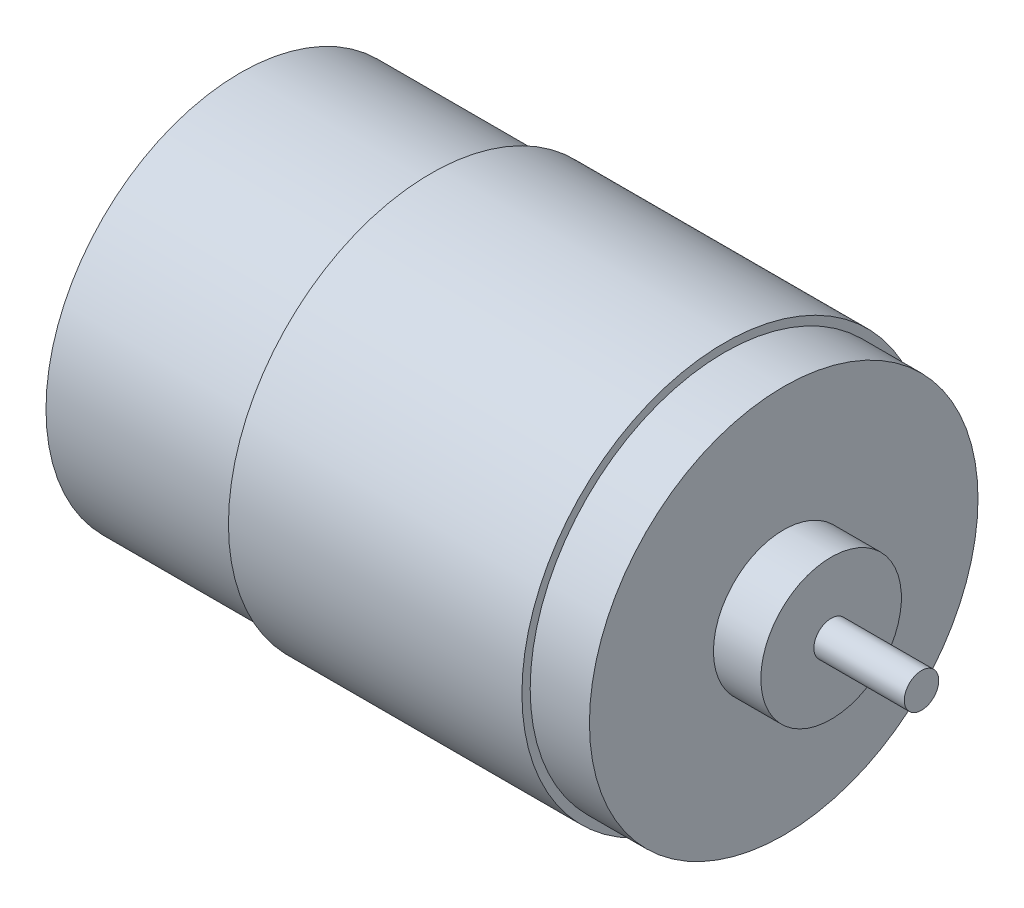
ISO-10303-21;
HEADER;
FILE_DESCRIPTION(('STEP AP214'),'2;1');
FILE_NAME('part.step','',(''),(''),'','','');
FILE_SCHEMA(('AUTOMOTIVE_DESIGN { 1 0 10303 214 1 1 1 1 }'));
ENDSEC;
DATA;
#1=APPLICATION_CONTEXT('core data for automotive mechanical design processes');
#2=APPLICATION_PROTOCOL_DEFINITION('international standard','automotive_design',2000,#1);
#3=PRODUCT_CONTEXT('',#1,'mechanical');
#4=PRODUCT('Part','Part','',(#3));
#5=PRODUCT_RELATED_PRODUCT_CATEGORY('part','',(#4));
#6=PRODUCT_DEFINITION_FORMATION('','',#4);
#7=PRODUCT_DEFINITION_CONTEXT('part definition',#1,'design');
#8=PRODUCT_DEFINITION('design','',#6,#7);
#9=PRODUCT_DEFINITION_SHAPE('','',#8);
#10=(LENGTH_UNIT() NAMED_UNIT(*) SI_UNIT(.MILLI.,.METRE.));
#11=(NAMED_UNIT(*) PLANE_ANGLE_UNIT() SI_UNIT($,.RADIAN.));
#12=(NAMED_UNIT(*) SI_UNIT($,.STERADIAN.) SOLID_ANGLE_UNIT());
#13=UNCERTAINTY_MEASURE_WITH_UNIT(LENGTH_MEASURE(1.E-05),#10,'distance_accuracy_value','');
#14=(GEOMETRIC_REPRESENTATION_CONTEXT(3) GLOBAL_UNCERTAINTY_ASSIGNED_CONTEXT((#13)) GLOBAL_UNIT_ASSIGNED_CONTEXT((#10,
#11,#12)) REPRESENTATION_CONTEXT('',''));
#15=CARTESIAN_POINT('',(0.,0.,0.));
#16=DIRECTION('',(0.,0.,1.));
#17=DIRECTION('',(1.,0.,0.));
#18=AXIS2_PLACEMENT_3D('',#15,#16,#17);
#19=CARTESIAN_POINT('',(-29.8040836820084,0.,0.));
#20=DIRECTION('',(1.,0.,0.));
#21=DIRECTION('',(0.,0.,-1.));
#22=AXIS2_PLACEMENT_3D('',#19,#20,#21);
#23=PLANE('',#22);
#24=CARTESIAN_POINT('',(-29.8040836820084,0.,0.));
#25=DIRECTION('',(-1.,0.,0.));
#26=DIRECTION('',(0.,0.,1.));
#27=AXIS2_PLACEMENT_3D('',#24,#25,#26);
#28=CIRCLE('',#27,1.53462761506276);
#29=CARTESIAN_POINT('',(-29.8040836820084,0.,1.53462761506276));
#30=VERTEX_POINT('',#29);
#31=EDGE_CURVE('E10',#30,#30,#28,.T.);
#32=ORIENTED_EDGE('',*,*,#31,.T.);
#33=EDGE_LOOP('',(#32));
#34=FACE_BOUND('',#33,.T.);
#35=ADVANCED_FACE('F33',(#34),#23,.F.);
#36=CARTESIAN_POINT('',(-37.6387615062761,0.,0.));
#37=DIRECTION('',(-1.,0.,0.));
#38=DIRECTION('',(0.,0.,1.));
#39=AXIS2_PLACEMENT_3D('',#36,#37,#38);
#40=CYLINDRICAL_SURFACE('',#39,1.53462761506276);
#41=ORIENTED_EDGE('',*,*,#31,.F.);
#42=EDGE_LOOP('',(#41));
#43=FACE_BOUND('',#42,.T.);
#44=CARTESIAN_POINT('',(-28.9156150627615,0.,0.));
#45=DIRECTION('',(-1.,0.,0.));
#46=DIRECTION('',(0.,0.,1.));
#47=AXIS2_PLACEMENT_3D('',#44,#45,#46);
#48=CIRCLE('',#47,1.53462761506276);
#49=CARTESIAN_POINT('',(-28.9156150627615,0.,1.53462761506276));
#50=VERTEX_POINT('',#49);
#51=EDGE_CURVE('E39',#50,#50,#48,.T.);
#52=ORIENTED_EDGE('',*,*,#51,.T.);
#53=EDGE_LOOP('',(#52));
#54=FACE_BOUND('',#53,.T.);
#55=ADVANCED_FACE('F104',(#43,#54),#40,.T.);
#56=CARTESIAN_POINT('',(-28.9156150627615,1.53462761506276,0.));
#57=DIRECTION('',(1.,0.,0.));
#58=DIRECTION('',(0.,0.,-1.));
#59=AXIS2_PLACEMENT_3D('',#56,#57,#58);
#60=PLANE('',#59);
#61=ORIENTED_EDGE('',*,*,#51,.F.);
#62=EDGE_LOOP('',(#61));
#63=FACE_BOUND('',#62,.T.);
#64=CARTESIAN_POINT('',(-28.9156150627615,0.,0.));
#65=DIRECTION('',(-1.,0.,0.));
#66=DIRECTION('',(0.,0.,1.));
#67=AXIS2_PLACEMENT_3D('',#64,#65,#66);
#68=CIRCLE('',#67,2.66540585774058);
#69=CARTESIAN_POINT('',(-28.9156150627615,0.,2.66540585774058));
#70=VERTEX_POINT('',#69);
#71=EDGE_CURVE('E43',#70,#70,#68,.T.);
#72=ORIENTED_EDGE('',*,*,#71,.T.);
#73=EDGE_LOOP('',(#72));
#74=FACE_BOUND('',#73,.T.);
#75=ADVANCED_FACE('F108',(#63,#74),#60,.F.);
#76=CARTESIAN_POINT('',(-37.6387615062761,0.,0.));
#77=DIRECTION('',(-1.,0.,0.));
#78=DIRECTION('',(0.,0.,1.));
#79=AXIS2_PLACEMENT_3D('',#76,#77,#78);
#80=CYLINDRICAL_SURFACE('',#79,2.66540585774058);
#81=ORIENTED_EDGE('',*,*,#71,.F.);
#82=EDGE_LOOP('',(#81));
#83=FACE_BOUND('',#82,.T.);
#84=CARTESIAN_POINT('',(-27.6232970711297,0.,0.));
#85=DIRECTION('',(-1.,0.,0.));
#86=DIRECTION('',(0.,0.,1.));
#87=AXIS2_PLACEMENT_3D('',#84,#85,#86);
#88=CIRCLE('',#87,2.66540585774058);
#89=CARTESIAN_POINT('',(-27.6232970711297,0.,2.66540585774058));
#90=VERTEX_POINT('',#89);
#91=EDGE_CURVE('E47',#90,#90,#88,.T.);
#92=ORIENTED_EDGE('',*,*,#91,.T.);
#93=EDGE_LOOP('',(#92));
#94=FACE_BOUND('',#93,.T.);
#95=ADVANCED_FACE('F113',(#83,#94),#80,.T.);
#96=CARTESIAN_POINT('',(-27.6232970711297,2.66540585774058,0.));
#97=DIRECTION('',(1.,0.,0.));
#98=DIRECTION('',(0.,0.,-1.));
#99=AXIS2_PLACEMENT_3D('',#96,#97,#98);
#100=PLANE('',#99);
#101=ORIENTED_EDGE('',*,*,#91,.F.);
#102=EDGE_LOOP('',(#101));
#103=FACE_BOUND('',#102,.T.);
#104=CARTESIAN_POINT('',(-27.6232970711297,0.,0.));
#105=DIRECTION('',(-1.,0.,0.));
#106=DIRECTION('',(0.,0.,1.));
#107=AXIS2_PLACEMENT_3D('',#104,#105,#106);
#108=CIRCLE('',#107,4.76542259414226);
#109=CARTESIAN_POINT('',(-27.6232970711297,0.,4.76542259414226));
#110=VERTEX_POINT('',#109);
#111=EDGE_CURVE('E52',#110,#110,#108,.T.);
#112=ORIENTED_EDGE('',*,*,#111,.T.);
#113=EDGE_LOOP('',(#112));
#114=FACE_BOUND('',#113,.T.);
#115=ADVANCED_FACE('F119',(#103,#114),#100,.F.);
#116=CARTESIAN_POINT('',(-26.6944435146444,0.,0.));
#117=DIRECTION('',(1.,0.,0.));
#118=DIRECTION('',(0.,0.,-1.));
#119=AXIS2_PLACEMENT_3D('',#116,#117,#118);
#120=CONICAL_SURFACE('',#119,5.69427615062763,0.785398163397459);
#121=ORIENTED_EDGE('',*,*,#111,.F.);
#122=EDGE_LOOP('',(#121));
#123=FACE_BOUND('',#122,.T.);
#124=CARTESIAN_POINT('',(-26.6944435146444,0.,0.));
#125=DIRECTION('',(-1.,0.,0.));
#126=DIRECTION('',(0.,0.,1.));
#127=AXIS2_PLACEMENT_3D('',#124,#125,#126);
#128=CIRCLE('',#127,5.69427615062763);
#129=CARTESIAN_POINT('',(-26.6944435146444,0.,5.69427615062763));
#130=VERTEX_POINT('',#129);
#131=EDGE_CURVE('E55',#130,#130,#128,.T.);
#132=ORIENTED_EDGE('',*,*,#131,.T.);
#133=EDGE_LOOP('',(#132));
#134=FACE_BOUND('',#133,.T.);
#135=ADVANCED_FACE('F123',(#123,#134),#120,.T.);
#136=CARTESIAN_POINT('',(-37.6387615062761,0.,0.));
#137=DIRECTION('',(-1.,0.,0.));
#138=DIRECTION('',(0.,0.,1.));
#139=AXIS2_PLACEMENT_3D('',#136,#137,#138);
#140=CYLINDRICAL_SURFACE('',#139,5.69427615062762);
#141=ORIENTED_EDGE('',*,*,#131,.F.);
#142=EDGE_LOOP('',(#141));
#143=FACE_BOUND('',#142,.T.);
#144=CARTESIAN_POINT('',(-24.6478836820084,0.,0.));
#145=DIRECTION('',(-1.,0.,0.));
#146=DIRECTION('',(0.,0.,1.));
#147=AXIS2_PLACEMENT_3D('',#144,#145,#146);
#148=CIRCLE('',#147,5.69427615062762);
#149=CARTESIAN_POINT('',(-24.6478836820084,0.,5.69427615062762));
#150=VERTEX_POINT('',#149);
#151=EDGE_CURVE('E58',#150,#150,#148,.T.);
#152=ORIENTED_EDGE('',*,*,#151,.T.);
#153=EDGE_LOOP('',(#152));
#154=FACE_BOUND('',#153,.T.);
#155=ADVANCED_FACE('F127',(#143,#154),#140,.T.);
#156=CARTESIAN_POINT('',(-24.6478836820084,5.69427615062762,0.));
#157=DIRECTION('',(1.,0.,0.));
#158=DIRECTION('',(0.,0.,-1.));
#159=AXIS2_PLACEMENT_3D('',#156,#157,#158);
#160=PLANE('',#159);
#161=ORIENTED_EDGE('',*,*,#151,.F.);
#162=EDGE_LOOP('',(#161));
#163=FACE_BOUND('',#162,.T.);
#164=CARTESIAN_POINT('',(-24.6478836820084,0.,0.));
#165=DIRECTION('',(-1.,0.,0.));
#166=DIRECTION('',(0.,0.,1.));
#167=AXIS2_PLACEMENT_3D('',#164,#165,#166);
#168=CIRCLE('',#167,17.907);
#169=CARTESIAN_POINT('',(-24.6478836820084,0.,17.907));
#170=VERTEX_POINT('',#169);
#171=EDGE_CURVE('E61',#170,#170,#168,.T.);
#172=ORIENTED_EDGE('',*,*,#171,.T.);
#173=EDGE_LOOP('',(#172));
#174=FACE_BOUND('',#173,.T.);
#175=ADVANCED_FACE('F131',(#163,#174),#160,.F.);
#176=CARTESIAN_POINT('',(-37.6387615062761,0.,0.));
#177=DIRECTION('',(-1.,0.,0.));
#178=DIRECTION('',(0.,0.,1.));
#179=AXIS2_PLACEMENT_3D('',#176,#177,#178);
#180=CYLINDRICAL_SURFACE('',#179,17.907);
#181=ORIENTED_EDGE('',*,*,#171,.F.);
#182=EDGE_LOOP('',(#181));
#183=FACE_BOUND('',#182,.T.);
#184=CARTESIAN_POINT('',(-7.07108368200839,0.,0.));
#185=DIRECTION('',(-1.,0.,0.));
#186=DIRECTION('',(0.,0.,1.));
#187=AXIS2_PLACEMENT_3D('',#184,#185,#186);
#188=CIRCLE('',#187,17.907);
#189=CARTESIAN_POINT('',(-7.07108368200839,0.,17.907));
#190=VERTEX_POINT('',#189);
#191=EDGE_CURVE('E64',#190,#190,#188,.T.);
#192=ORIENTED_EDGE('',*,*,#191,.T.);
#193=EDGE_LOOP('',(#192));
#194=FACE_BOUND('',#193,.T.);
#195=ADVANCED_FACE('F135',(#183,#194),#180,.T.);
#196=CARTESIAN_POINT('',(-7.07108368200839,17.907,0.));
#197=DIRECTION('',(1.,0.,0.));
#198=DIRECTION('',(0.,0.,-1.));
#199=AXIS2_PLACEMENT_3D('',#196,#197,#198);
#200=PLANE('',#199);
#201=ORIENTED_EDGE('',*,*,#191,.F.);
#202=EDGE_LOOP('',(#201));
#203=FACE_BOUND('',#202,.T.);
#204=CARTESIAN_POINT('',(-7.07108368200839,0.,0.));
#205=DIRECTION('',(-1.,0.,0.));
#206=DIRECTION('',(0.,0.,1.));
#207=AXIS2_PLACEMENT_3D('',#204,#205,#206);
#208=CIRCLE('',#207,18.669);
#209=CARTESIAN_POINT('',(-7.07108368200839,0.,18.669));
#210=VERTEX_POINT('',#209);
#211=EDGE_CURVE('E67',#210,#210,#208,.T.);
#212=ORIENTED_EDGE('',*,*,#211,.T.);
#213=EDGE_LOOP('',(#212));
#214=FACE_BOUND('',#213,.T.);
#215=ADVANCED_FACE('F139',(#203,#214),#200,.F.);
#216=CARTESIAN_POINT('',(-37.6387615062761,0.,0.));
#217=DIRECTION('',(-1.,0.,0.));
#218=DIRECTION('',(0.,0.,1.));
#219=AXIS2_PLACEMENT_3D('',#216,#217,#218);
#220=CYLINDRICAL_SURFACE('',#219,18.669);
#221=ORIENTED_EDGE('',*,*,#211,.F.);
#222=EDGE_LOOP('',(#221));
#223=FACE_BOUND('',#222,.T.);
#224=CARTESIAN_POINT('',(19.9799163179916,0.,0.));
#225=DIRECTION('',(-1.,0.,0.));
#226=DIRECTION('',(0.,0.,1.));
#227=AXIS2_PLACEMENT_3D('',#224,#225,#226);
#228=CIRCLE('',#227,18.669);
#229=CARTESIAN_POINT('',(19.9799163179916,0.,18.669));
#230=VERTEX_POINT('',#229);
#231=EDGE_CURVE('E70',#230,#230,#228,.T.);
#232=ORIENTED_EDGE('',*,*,#231,.T.);
#233=EDGE_LOOP('',(#232));
#234=FACE_BOUND('',#233,.T.);
#235=ADVANCED_FACE('F143',(#223,#234),#220,.T.);
#236=CARTESIAN_POINT('',(19.9799163179916,18.669,0.));
#237=DIRECTION('',(-1.,0.,0.));
#238=DIRECTION('',(0.,0.,1.));
#239=AXIS2_PLACEMENT_3D('',#236,#237,#238);
#240=PLANE('',#239);
#241=ORIENTED_EDGE('',*,*,#231,.F.);
#242=EDGE_LOOP('',(#241));
#243=FACE_BOUND('',#242,.T.);
#244=CARTESIAN_POINT('',(19.9799163179916,0.,0.));
#245=DIRECTION('',(-1.,0.,0.));
#246=DIRECTION('',(0.,0.,1.));
#247=AXIS2_PLACEMENT_3D('',#244,#245,#246);
#248=CIRCLE('',#247,17.907);
#249=CARTESIAN_POINT('',(19.9799163179916,0.,17.907));
#250=VERTEX_POINT('',#249);
#251=EDGE_CURVE('E73',#250,#250,#248,.T.);
#252=ORIENTED_EDGE('',*,*,#251,.T.);
#253=EDGE_LOOP('',(#252));
#254=FACE_BOUND('',#253,.T.);
#255=ADVANCED_FACE('F147',(#243,#254),#240,.F.);
#256=CARTESIAN_POINT('',(-37.6387615062761,0.,0.));
#257=DIRECTION('',(-1.,0.,0.));
#258=DIRECTION('',(0.,0.,1.));
#259=AXIS2_PLACEMENT_3D('',#256,#257,#258);
#260=CYLINDRICAL_SURFACE('',#259,17.907);
#261=ORIENTED_EDGE('',*,*,#251,.F.);
#262=EDGE_LOOP('',(#261));
#263=FACE_BOUND('',#262,.T.);
#264=CARTESIAN_POINT('',(25.4409163179916,0.,0.));
#265=DIRECTION('',(-1.,0.,0.));
#266=DIRECTION('',(0.,0.,1.));
#267=AXIS2_PLACEMENT_3D('',#264,#265,#266);
#268=CIRCLE('',#267,17.907);
#269=CARTESIAN_POINT('',(25.4409163179916,0.,17.907));
#270=VERTEX_POINT('',#269);
#271=EDGE_CURVE('E76',#270,#270,#268,.T.);
#272=ORIENTED_EDGE('',*,*,#271,.T.);
#273=EDGE_LOOP('',(#272));
#274=FACE_BOUND('',#273,.T.);
#275=ADVANCED_FACE('F151',(#263,#274),#260,.T.);
#276=CARTESIAN_POINT('',(25.4409163179916,17.907,0.));
#277=DIRECTION('',(-1.,0.,0.));
#278=DIRECTION('',(0.,0.,1.));
#279=AXIS2_PLACEMENT_3D('',#276,#277,#278);
#280=PLANE('',#279);
#281=ORIENTED_EDGE('',*,*,#271,.F.);
#282=EDGE_LOOP('',(#281));
#283=FACE_BOUND('',#282,.T.);
#284=CARTESIAN_POINT('',(25.4409163179916,0.,0.));
#285=DIRECTION('',(-1.,0.,0.));
#286=DIRECTION('',(0.,0.,1.));
#287=AXIS2_PLACEMENT_3D('',#284,#285,#286);
#288=CIRCLE('',#287,6.477);
#289=CARTESIAN_POINT('',(25.4409163179916,0.,6.477));
#290=VERTEX_POINT('',#289);
#291=EDGE_CURVE('E79',#290,#290,#288,.T.);
#292=ORIENTED_EDGE('',*,*,#291,.T.);
#293=EDGE_LOOP('',(#292));
#294=FACE_BOUND('',#293,.T.);
#295=ADVANCED_FACE('F155',(#283,#294),#280,.F.);
#296=CARTESIAN_POINT('',(-37.6387615062761,0.,0.));
#297=DIRECTION('',(-1.,0.,0.));
#298=DIRECTION('',(0.,0.,1.));
#299=AXIS2_PLACEMENT_3D('',#296,#297,#298);
#300=CYLINDRICAL_SURFACE('',#299,6.477);
#301=ORIENTED_EDGE('',*,*,#291,.F.);
#302=EDGE_LOOP('',(#301));
#303=FACE_BOUND('',#302,.T.);
#304=CARTESIAN_POINT('',(29.8097163179916,0.,0.));
#305=DIRECTION('',(-1.,0.,0.));
#306=DIRECTION('',(0.,0.,1.));
#307=AXIS2_PLACEMENT_3D('',#304,#305,#306);
#308=CIRCLE('',#307,6.477);
#309=CARTESIAN_POINT('',(29.8097163179916,0.,6.477));
#310=VERTEX_POINT('',#309);
#311=EDGE_CURVE('E82',#310,#310,#308,.T.);
#312=ORIENTED_EDGE('',*,*,#311,.T.);
#313=EDGE_LOOP('',(#312));
#314=FACE_BOUND('',#313,.T.);
#315=ADVANCED_FACE('F159',(#303,#314),#300,.T.);
#316=CARTESIAN_POINT('',(29.8097163179916,6.477,0.));
#317=DIRECTION('',(-1.,0.,0.));
#318=DIRECTION('',(0.,0.,1.));
#319=AXIS2_PLACEMENT_3D('',#316,#317,#318);
#320=PLANE('',#319);
#321=ORIENTED_EDGE('',*,*,#311,.F.);
#322=EDGE_LOOP('',(#321));
#323=FACE_BOUND('',#322,.T.);
#324=CARTESIAN_POINT('',(29.8097163179916,0.,0.));
#325=DIRECTION('',(-1.,0.,0.));
#326=DIRECTION('',(0.,0.,1.));
#327=AXIS2_PLACEMENT_3D('',#324,#325,#326);
#328=CIRCLE('',#327,1.5875);
#329=CARTESIAN_POINT('',(29.8097163179916,0.,1.5875));
#330=VERTEX_POINT('',#329);
#331=EDGE_CURVE('E85',#330,#330,#328,.T.);
#332=ORIENTED_EDGE('',*,*,#331,.T.);
#333=EDGE_LOOP('',(#332));
#334=FACE_BOUND('',#333,.T.);
#335=ADVANCED_FACE('F100',(#323,#334),#320,.F.);
#336=CARTESIAN_POINT('',(-37.6387615062761,0.,0.));
#337=DIRECTION('',(-1.,0.,0.));
#338=DIRECTION('',(0.,0.,1.));
#339=AXIS2_PLACEMENT_3D('',#336,#337,#338);
#340=CYLINDRICAL_SURFACE('',#339,1.5875);
#341=ORIENTED_EDGE('',*,*,#331,.F.);
#342=EDGE_LOOP('',(#341));
#343=FACE_BOUND('',#342,.T.);
#344=CARTESIAN_POINT('',(38.1409163179916,0.,0.));
#345=DIRECTION('',(-1.,0.,0.));
#346=DIRECTION('',(0.,0.,1.));
#347=AXIS2_PLACEMENT_3D('',#344,#345,#346);
#348=CIRCLE('',#347,1.5875);
#349=CARTESIAN_POINT('',(38.1409163179916,0.,1.5875));
#350=VERTEX_POINT('',#349);
#351=EDGE_CURVE('E88',#350,#350,#348,.T.);
#352=ORIENTED_EDGE('',*,*,#351,.T.);
#353=EDGE_LOOP('',(#352));
#354=FACE_BOUND('',#353,.T.);
#355=ADVANCED_FACE('F92',(#343,#354),#340,.T.);
#356=CARTESIAN_POINT('',(38.1409163179916,1.5875,0.));
#357=DIRECTION('',(-1.,0.,0.));
#358=DIRECTION('',(0.,0.,1.));
#359=AXIS2_PLACEMENT_3D('',#356,#357,#358);
#360=PLANE('',#359);
#361=ORIENTED_EDGE('',*,*,#351,.F.);
#362=EDGE_LOOP('',(#361));
#363=FACE_BOUND('',#362,.T.);
#364=ADVANCED_FACE('F94',(#363),#360,.F.);
#365=CLOSED_SHELL('',(#35,#55,#75,#95,#115,#135,#155,#175,#195,#215,#235,#255,#275,#295,#315,
#335,#355,#364));
#366=MANIFOLD_SOLID_BREP('B2',#365);
#367=ADVANCED_BREP_SHAPE_REPRESENTATION('',(#18,#366),#14);
#368=SHAPE_DEFINITION_REPRESENTATION(#9,#367);
ENDSEC;
END-ISO-10303-21;
